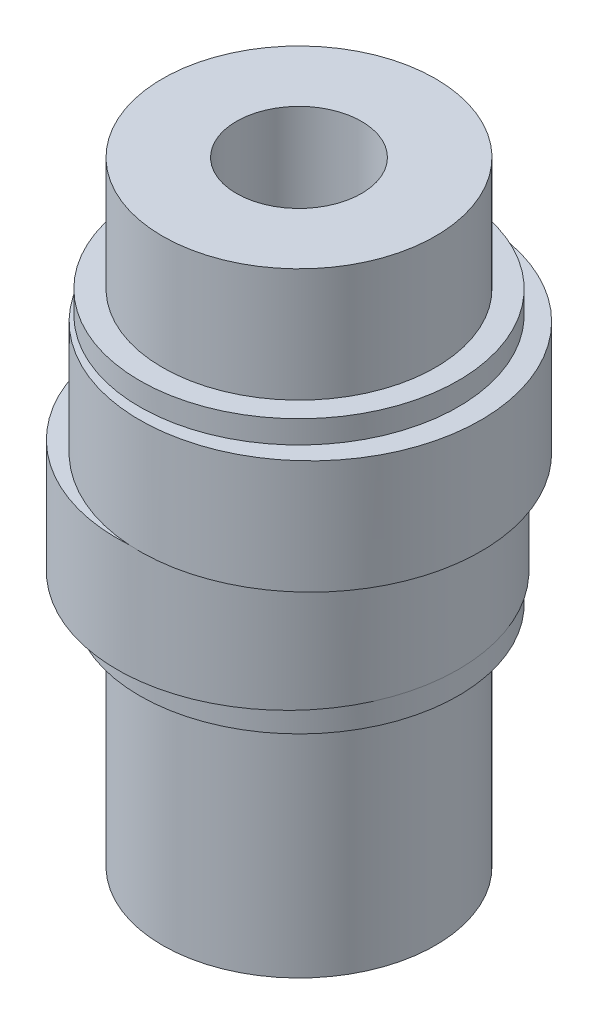
ISO-10303-21;
HEADER;
FILE_DESCRIPTION(('STEP AP214'),'2;1');
FILE_NAME('part.step','',(''),(''),'','','');
FILE_SCHEMA(('AUTOMOTIVE_DESIGN { 1 0 10303 214 1 1 1 1 }'));
ENDSEC;
DATA;
#1=APPLICATION_CONTEXT('core data for automotive mechanical design processes');
#2=APPLICATION_PROTOCOL_DEFINITION('international standard','automotive_design',2000,#1);
#3=PRODUCT_CONTEXT('',#1,'mechanical');
#4=PRODUCT('Part','Part','',(#3));
#5=PRODUCT_RELATED_PRODUCT_CATEGORY('part','',(#4));
#6=PRODUCT_DEFINITION_FORMATION('','',#4);
#7=PRODUCT_DEFINITION_CONTEXT('part definition',#1,'design');
#8=PRODUCT_DEFINITION('design','',#6,#7);
#9=PRODUCT_DEFINITION_SHAPE('','',#8);
#10=(LENGTH_UNIT() NAMED_UNIT(*) SI_UNIT(.MILLI.,.METRE.));
#11=(NAMED_UNIT(*) PLANE_ANGLE_UNIT() SI_UNIT($,.RADIAN.));
#12=(NAMED_UNIT(*) SI_UNIT($,.STERADIAN.) SOLID_ANGLE_UNIT());
#13=UNCERTAINTY_MEASURE_WITH_UNIT(LENGTH_MEASURE(1.E-05),#10,'distance_accuracy_value','');
#14=(GEOMETRIC_REPRESENTATION_CONTEXT(3) GLOBAL_UNCERTAINTY_ASSIGNED_CONTEXT((#13)) GLOBAL_UNIT_ASSIGNED_CONTEXT((#10,
#11,#12)) REPRESENTATION_CONTEXT('',''));
#15=CARTESIAN_POINT('',(0.,0.,0.));
#16=DIRECTION('',(0.,0.,1.));
#17=DIRECTION('',(1.,0.,0.));
#18=AXIS2_PLACEMENT_3D('',#15,#16,#17);
#19=CARTESIAN_POINT('',(-0.5,5.,0.));
#20=DIRECTION('',(0.,-1.,0.));
#21=DIRECTION('',(0.,0.,-1.));
#22=AXIS2_PLACEMENT_3D('',#19,#20,#21);
#23=CYLINDRICAL_SURFACE('',#22,7.5);
#24=CARTESIAN_POINT('',(-0.5,5.,0.));
#25=DIRECTION('',(0.,1.,0.));
#26=DIRECTION('',(0.,0.,1.));
#27=AXIS2_PLACEMENT_3D('',#24,#25,#26);
#28=CIRCLE('',#27,7.5);
#29=CARTESIAN_POINT('',(0.,5.,7.48331477354788));
#30=VERTEX_POINT('',#29);
#31=CARTESIAN_POINT('',(0.,5.,-7.48331477354788));
#32=VERTEX_POINT('',#31);
#33=EDGE_CURVE('E149',#30,#32,#28,.T.);
#34=ORIENTED_EDGE('',*,*,#33,.F.);
#35=EDGE_CURVE('E169',#32,#30,#28,.T.);
#36=ORIENTED_EDGE('',*,*,#35,.F.);
#37=EDGE_LOOP('',(#34,#36));
#38=FACE_BOUND('',#37,.T.);
#39=CARTESIAN_POINT('',(-0.5,0.,0.));
#40=DIRECTION('',(0.,1.,0.));
#41=DIRECTION('',(0.,0.,1.));
#42=AXIS2_PLACEMENT_3D('',#39,#40,#41);
#43=CIRCLE('',#42,7.5);
#44=CARTESIAN_POINT('',(7.,0.,0.));
#45=VERTEX_POINT('',#44);
#46=EDGE_CURVE('E162',#45,#45,#43,.T.);
#47=ORIENTED_EDGE('',*,*,#46,.T.);
#48=EDGE_LOOP('',(#47));
#49=FACE_BOUND('',#48,.T.);
#50=ADVANCED_FACE('F58',(#38,#49),#23,.T.);
#51=CARTESIAN_POINT('',(-0.5,5.,0.));
#52=DIRECTION('',(0.,1.,0.));
#53=DIRECTION('',(0.,0.,1.));
#54=AXIS2_PLACEMENT_3D('',#51,#52,#53);
#55=PLANE('',#54);
#56=CARTESIAN_POINT('',(0.5,5.,0.));
#57=DIRECTION('',(0.,1.,0.));
#58=DIRECTION('',(0.,0.,1.));
#59=AXIS2_PLACEMENT_3D('',#56,#57,#58);
#60=CIRCLE('',#59,7.5);
#61=EDGE_CURVE('E163',#32,#30,#60,.T.);
#62=ORIENTED_EDGE('',*,*,#61,.F.);
#63=ORIENTED_EDGE('',*,*,#35,.T.);
#64=EDGE_LOOP('',(#62,#63));
#65=FACE_BOUND('',#64,.T.);
#66=ADVANCED_FACE('F183',(#65),#55,.T.);
#67=CARTESIAN_POINT('',(-0.5,0.,0.));
#68=DIRECTION('',(0.,1.,0.));
#69=DIRECTION('',(0.,0.,1.));
#70=AXIS2_PLACEMENT_3D('',#67,#68,#69);
#71=PLANE('',#70);
#72=ORIENTED_EDGE('',*,*,#46,.F.);
#73=CARTESIAN_POINT('',(0.,0.,0.));
#74=DIRECTION('',(0.,1.,0.));
#75=DIRECTION('',(0.,0.,1.));
#76=AXIS2_PLACEMENT_3D('',#73,#74,#75);
#77=CIRCLE('',#76,7.);
#78=EDGE_CURVE('E80',#45,#45,#77,.T.);
#79=ORIENTED_EDGE('',*,*,#78,.T.);
#80=EDGE_LOOP('',(#72,#79));
#81=FACE_BOUND('',#80,.T.);
#82=ADVANCED_FACE('F202',(#81),#71,.F.);
#83=CARTESIAN_POINT('',(0.5,5.,0.));
#84=DIRECTION('',(0.,1.,0.));
#85=DIRECTION('',(0.,0.,1.));
#86=AXIS2_PLACEMENT_3D('',#83,#84,#85);
#87=PLANE('',#86);
#88=EDGE_CURVE('E154',#30,#32,#60,.T.);
#89=ORIENTED_EDGE('',*,*,#88,.F.);
#90=ORIENTED_EDGE('',*,*,#33,.T.);
#91=EDGE_LOOP('',(#89,#90));
#92=FACE_BOUND('',#91,.T.);
#93=ADVANCED_FACE('F187',(#92),#87,.F.);
#94=CARTESIAN_POINT('',(0.5,10.,0.));
#95=DIRECTION('',(0.,-1.,0.));
#96=DIRECTION('',(0.,0.,-1.));
#97=AXIS2_PLACEMENT_3D('',#94,#95,#96);
#98=CYLINDRICAL_SURFACE('',#97,7.5);
#99=CARTESIAN_POINT('',(0.5,10.,0.));
#100=DIRECTION('',(0.,1.,0.));
#101=DIRECTION('',(0.,0.,1.));
#102=AXIS2_PLACEMENT_3D('',#99,#100,#101);
#103=CIRCLE('',#102,7.5);
#104=CARTESIAN_POINT('',(-7.,10.,0.));
#105=VERTEX_POINT('',#104);
#106=EDGE_CURVE('E158',#105,#105,#103,.T.);
#107=ORIENTED_EDGE('',*,*,#106,.F.);
#108=EDGE_LOOP('',(#107));
#109=FACE_BOUND('',#108,.T.);
#110=ORIENTED_EDGE('',*,*,#61,.T.);
#111=ORIENTED_EDGE('',*,*,#88,.T.);
#112=EDGE_LOOP('',(#110,#111));
#113=FACE_BOUND('',#112,.T.);
#114=ADVANCED_FACE('F190',(#109,#113),#98,.T.);
#115=CARTESIAN_POINT('',(0.5,10.,0.));
#116=DIRECTION('',(0.,1.,0.));
#117=DIRECTION('',(0.,0.,1.));
#118=AXIS2_PLACEMENT_3D('',#115,#116,#117);
#119=PLANE('',#118);
#120=ORIENTED_EDGE('',*,*,#106,.T.);
#121=CARTESIAN_POINT('',(0.,10.,0.));
#122=DIRECTION('',(0.,1.,0.));
#123=DIRECTION('',(0.,0.,1.));
#124=AXIS2_PLACEMENT_3D('',#121,#122,#123);
#125=CIRCLE('',#124,7.);
#126=EDGE_CURVE('E145',#105,#105,#125,.T.);
#127=ORIENTED_EDGE('',*,*,#126,.F.);
#128=EDGE_LOOP('',(#120,#127));
#129=FACE_BOUND('',#128,.T.);
#130=ADVANCED_FACE('F192',(#129),#119,.T.);
#131=CARTESIAN_POINT('',(0.,11.,0.));
#132=DIRECTION('',(0.,-1.,0.));
#133=DIRECTION('',(0.,0.,-1.));
#134=AXIS2_PLACEMENT_3D('',#131,#132,#133);
#135=CYLINDRICAL_SURFACE('',#134,7.);
#136=CARTESIAN_POINT('',(0.,11.,0.));
#137=DIRECTION('',(0.,1.,0.));
#138=DIRECTION('',(0.,0.,1.));
#139=AXIS2_PLACEMENT_3D('',#136,#137,#138);
#140=CIRCLE('',#139,7.);
#141=CARTESIAN_POINT('',(0.,11.,7.));
#142=VERTEX_POINT('',#141);
#143=EDGE_CURVE('E150',#142,#142,#140,.T.);
#144=ORIENTED_EDGE('',*,*,#143,.F.);
#145=EDGE_LOOP('',(#144));
#146=FACE_BOUND('',#145,.T.);
#147=ORIENTED_EDGE('',*,*,#126,.T.);
#148=EDGE_LOOP('',(#147));
#149=FACE_BOUND('',#148,.T.);
#150=ADVANCED_FACE('F199',(#146,#149),#135,.T.);
#151=CARTESIAN_POINT('',(0.,11.,0.));
#152=DIRECTION('',(0.,1.,0.));
#153=DIRECTION('',(0.,0.,1.));
#154=AXIS2_PLACEMENT_3D('',#151,#152,#153);
#155=PLANE('',#154);
#156=CARTESIAN_POINT('',(0.,11.,0.));
#157=DIRECTION('',(0.,1.,0.));
#158=DIRECTION('',(0.,0.,1.));
#159=AXIS2_PLACEMENT_3D('',#156,#157,#158);
#160=CIRCLE('',#159,6.);
#161=CARTESIAN_POINT('',(0.,11.,6.));
#162=VERTEX_POINT('',#161);
#163=EDGE_CURVE('E67',#162,#162,#160,.T.);
#164=ORIENTED_EDGE('',*,*,#163,.F.);
#165=EDGE_LOOP('',(#164));
#166=FACE_BOUND('',#165,.T.);
#167=ORIENTED_EDGE('',*,*,#143,.T.);
#168=EDGE_LOOP('',(#167));
#169=FACE_BOUND('',#168,.T.);
#170=ADVANCED_FACE('F239',(#166,#169),#155,.T.);
#171=CARTESIAN_POINT('',(0.,16.,0.));
#172=DIRECTION('',(0.,-1.,0.));
#173=DIRECTION('',(0.,0.,-1.));
#174=AXIS2_PLACEMENT_3D('',#171,#172,#173);
#175=CYLINDRICAL_SURFACE('',#174,6.);
#176=CARTESIAN_POINT('',(0.,16.,0.));
#177=DIRECTION('',(0.,1.,0.));
#178=DIRECTION('',(0.,0.,1.));
#179=AXIS2_PLACEMENT_3D('',#176,#177,#178);
#180=CIRCLE('',#179,6.);
#181=CARTESIAN_POINT('',(0.,16.,6.));
#182=VERTEX_POINT('',#181);
#183=EDGE_CURVE('E139',#182,#182,#180,.T.);
#184=ORIENTED_EDGE('',*,*,#183,.F.);
#185=EDGE_LOOP('',(#184));
#186=FACE_BOUND('',#185,.T.);
#187=ORIENTED_EDGE('',*,*,#163,.T.);
#188=EDGE_LOOP('',(#187));
#189=FACE_BOUND('',#188,.T.);
#190=ADVANCED_FACE('F249',(#186,#189),#175,.T.);
#191=CARTESIAN_POINT('',(0.,16.,0.));
#192=DIRECTION('',(0.,1.,0.));
#193=DIRECTION('',(0.,0.,1.));
#194=AXIS2_PLACEMENT_3D('',#191,#192,#193);
#195=PLANE('',#194);
#196=CARTESIAN_POINT('',(0.,16.,0.));
#197=DIRECTION('',(0.,1.,0.));
#198=DIRECTION('',(0.,0.,1.));
#199=AXIS2_PLACEMENT_3D('',#196,#197,#198);
#200=CIRCLE('',#199,2.75);
#201=CARTESIAN_POINT('',(0.,16.,2.75));
#202=VERTEX_POINT('',#201);
#203=EDGE_CURVE('E442',#202,#202,#200,.T.);
#204=ORIENTED_EDGE('',*,*,#203,.F.);
#205=EDGE_LOOP('',(#204));
#206=FACE_BOUND('',#205,.T.);
#207=ORIENTED_EDGE('',*,*,#183,.T.);
#208=EDGE_LOOP('',(#207));
#209=FACE_BOUND('',#208,.T.);
#210=ADVANCED_FACE('F259',(#206,#209),#195,.T.);
#211=CARTESIAN_POINT('',(0.,-1.,0.));
#212=DIRECTION('',(0.,1.,0.));
#213=DIRECTION('',(0.,0.,1.));
#214=AXIS2_PLACEMENT_3D('',#211,#212,#213);
#215=CYLINDRICAL_SURFACE('',#214,7.);
#216=CARTESIAN_POINT('',(0.,-1.,0.));
#217=DIRECTION('',(0.,1.,0.));
#218=DIRECTION('',(0.,0.,1.));
#219=AXIS2_PLACEMENT_3D('',#216,#217,#218);
#220=CIRCLE('',#219,7.);
#221=CARTESIAN_POINT('',(0.,-1.,7.));
#222=VERTEX_POINT('',#221);
#223=EDGE_CURVE('E135',#222,#222,#220,.T.);
#224=ORIENTED_EDGE('',*,*,#223,.T.);
#225=EDGE_LOOP('',(#224));
#226=FACE_BOUND('',#225,.T.);
#227=ORIENTED_EDGE('',*,*,#78,.F.);
#228=EDGE_LOOP('',(#227));
#229=FACE_BOUND('',#228,.T.);
#230=ADVANCED_FACE('F270',(#226,#229),#215,.T.);
#231=CARTESIAN_POINT('',(0.,-1.,0.));
#232=DIRECTION('',(0.,1.,0.));
#233=DIRECTION('',(0.,0.,1.));
#234=AXIS2_PLACEMENT_3D('',#231,#232,#233);
#235=PLANE('',#234);
#236=CARTESIAN_POINT('',(0.,-1.,0.));
#237=DIRECTION('',(0.,-1.,0.));
#238=DIRECTION('',(0.,0.,-1.));
#239=AXIS2_PLACEMENT_3D('',#236,#237,#238);
#240=CIRCLE('',#239,6.);
#241=CARTESIAN_POINT('',(0.,-1.,-6.));
#242=VERTEX_POINT('',#241);
#243=EDGE_CURVE('E13',#242,#242,#240,.T.);
#244=ORIENTED_EDGE('',*,*,#243,.F.);
#245=EDGE_LOOP('',(#244));
#246=FACE_BOUND('',#245,.T.);
#247=ORIENTED_EDGE('',*,*,#223,.F.);
#248=EDGE_LOOP('',(#247));
#249=FACE_BOUND('',#248,.T.);
#250=ADVANCED_FACE('F282',(#246,#249),#235,.F.);
#251=CARTESIAN_POINT('',(0.,-6.,0.));
#252=DIRECTION('',(0.,1.,0.));
#253=DIRECTION('',(0.,0.,1.));
#254=AXIS2_PLACEMENT_3D('',#251,#252,#253);
#255=CYLINDRICAL_SURFACE('',#254,6.);
#256=ORIENTED_EDGE('',*,*,#243,.T.);
#257=EDGE_LOOP('',(#256));
#258=FACE_BOUND('',#257,.T.);
#259=CARTESIAN_POINT('',(0.,-11.,0.));
#260=DIRECTION('',(0.,-1.,0.));
#261=DIRECTION('',(0.,0.,-1.));
#262=AXIS2_PLACEMENT_3D('',#259,#260,#261);
#263=CIRCLE('',#262,6.);
#264=CARTESIAN_POINT('',(0.,-11.,-6.));
#265=VERTEX_POINT('',#264);
#266=EDGE_CURVE('E120',#265,#265,#263,.T.);
#267=ORIENTED_EDGE('',*,*,#266,.F.);
#268=EDGE_LOOP('',(#267));
#269=FACE_BOUND('',#268,.T.);
#270=ADVANCED_FACE('F292',(#258,#269),#255,.T.);
#271=CARTESIAN_POINT('',(-3.,-11.,0.));
#272=DIRECTION('',(1.,0.,0.));
#273=DIRECTION('',(0.,0.,-1.));
#274=AXIS2_PLACEMENT_3D('',#271,#272,#273);
#275=PLANE('',#274);
#276=DIRECTION('',(0.,0.,-1.));
#277=VECTOR('',#276,1.);
#278=CARTESIAN_POINT('',(-3.,-6.,0.));
#279=LINE('',#278,#277);
#280=CARTESIAN_POINT('',(-3.,-6.,4.));
#281=VERTEX_POINT('',#280);
#282=CARTESIAN_POINT('',(-3.,-6.,-4.));
#283=VERTEX_POINT('',#282);
#284=EDGE_CURVE('E106',#281,#283,#279,.T.);
#285=ORIENTED_EDGE('',*,*,#284,.F.);
#286=DIRECTION('',(0.,1.,0.));
#287=VECTOR('',#286,1.);
#288=CARTESIAN_POINT('',(-3.,-11.,4.));
#289=LINE('',#288,#287);
#290=CARTESIAN_POINT('',(-3.,-11.,4.));
#291=VERTEX_POINT('',#290);
#292=EDGE_CURVE('E100',#291,#281,#289,.T.);
#293=ORIENTED_EDGE('',*,*,#292,.F.);
#294=DIRECTION('',(0.,0.,-1.));
#295=VECTOR('',#294,1.);
#296=CARTESIAN_POINT('',(-3.,-11.,0.));
#297=LINE('',#296,#295);
#298=CARTESIAN_POINT('',(-3.,-11.,-4.));
#299=VERTEX_POINT('',#298);
#300=EDGE_CURVE('E104',#291,#299,#297,.T.);
#301=ORIENTED_EDGE('',*,*,#300,.T.);
#302=DIRECTION('',(0.,1.,0.));
#303=VECTOR('',#302,1.);
#304=CARTESIAN_POINT('',(-3.,-11.,-4.));
#305=LINE('',#304,#303);
#306=EDGE_CURVE('E110',#299,#283,#305,.T.);
#307=ORIENTED_EDGE('',*,*,#306,.T.);
#308=EDGE_LOOP('',(#285,#293,#301,#307));
#309=FACE_BOUND('',#308,.T.);
#310=ADVANCED_FACE('F102',(#309),#275,.T.);
#311=CARTESIAN_POINT('',(0.,-11.,0.));
#312=DIRECTION('',(0.,1.,0.));
#313=DIRECTION('',(0.,0.,1.));
#314=AXIS2_PLACEMENT_3D('',#311,#312,#313);
#315=CYLINDRICAL_SURFACE('',#314,5.);
#316=CARTESIAN_POINT('',(0.,-6.,0.));
#317=DIRECTION('',(0.,-1.,0.));
#318=DIRECTION('',(0.,0.,-1.));
#319=AXIS2_PLACEMENT_3D('',#316,#317,#318);
#320=CIRCLE('',#319,5.);
#321=EDGE_CURVE('E74',#283,#281,#320,.T.);
#322=ORIENTED_EDGE('',*,*,#321,.F.);
#323=ORIENTED_EDGE('',*,*,#306,.F.);
#324=CARTESIAN_POINT('',(0.,-11.,0.));
#325=DIRECTION('',(0.,-1.,0.));
#326=DIRECTION('',(0.,0.,-1.));
#327=AXIS2_PLACEMENT_3D('',#324,#325,#326);
#328=CIRCLE('',#327,5.);
#329=EDGE_CURVE('E115',#299,#291,#328,.T.);
#330=ORIENTED_EDGE('',*,*,#329,.T.);
#331=ORIENTED_EDGE('',*,*,#292,.T.);
#332=EDGE_LOOP('',(#322,#323,#330,#331));
#333=FACE_BOUND('',#332,.T.);
#334=ADVANCED_FACE('F118',(#333),#315,.F.);
#335=CARTESIAN_POINT('',(0.,-11.,0.));
#336=DIRECTION('',(0.,-1.,0.));
#337=DIRECTION('',(0.,0.,-1.));
#338=AXIS2_PLACEMENT_3D('',#335,#336,#337);
#339=PLANE('',#338);
#340=ORIENTED_EDGE('',*,*,#300,.F.);
#341=ORIENTED_EDGE('',*,*,#329,.F.);
#342=EDGE_LOOP('',(#340,#341));
#343=FACE_BOUND('',#342,.T.);
#344=ORIENTED_EDGE('',*,*,#266,.T.);
#345=EDGE_LOOP('',(#344));
#346=FACE_BOUND('',#345,.T.);
#347=ADVANCED_FACE('F113',(#343,#346),#339,.T.);
#348=CARTESIAN_POINT('',(0.,-6.,0.));
#349=DIRECTION('',(0.,-1.,0.));
#350=DIRECTION('',(0.,0.,-1.));
#351=AXIS2_PLACEMENT_3D('',#348,#349,#350);
#352=PLANE('',#351);
#353=CARTESIAN_POINT('',(0.,-6.,0.));
#354=DIRECTION('',(0.,-1.,0.));
#355=DIRECTION('',(0.,0.,-1.));
#356=AXIS2_PLACEMENT_3D('',#353,#354,#355);
#357=CIRCLE('',#356,2.75);
#358=CARTESIAN_POINT('',(0.,-6.,-2.75));
#359=VERTEX_POINT('',#358);
#360=EDGE_CURVE('E61',#359,#359,#357,.T.);
#361=ORIENTED_EDGE('',*,*,#360,.F.);
#362=EDGE_LOOP('',(#361));
#363=FACE_BOUND('',#362,.T.);
#364=ORIENTED_EDGE('',*,*,#284,.T.);
#365=ORIENTED_EDGE('',*,*,#321,.T.);
#366=EDGE_LOOP('',(#364,#365));
#367=FACE_BOUND('',#366,.T.);
#368=ADVANCED_FACE('F326',(#363,#367),#352,.T.);
#369=CARTESIAN_POINT('',(0.,-11.,0.));
#370=DIRECTION('',(0.,1.,0.));
#371=DIRECTION('',(0.,0.,1.));
#372=AXIS2_PLACEMENT_3D('',#369,#370,#371);
#373=CYLINDRICAL_SURFACE('',#372,2.75);
#374=ORIENTED_EDGE('',*,*,#360,.T.);
#375=EDGE_LOOP('',(#374));
#376=FACE_BOUND('',#375,.T.);
#377=ORIENTED_EDGE('',*,*,#203,.T.);
#378=EDGE_LOOP('',(#377));
#379=FACE_BOUND('',#378,.T.);
#380=ADVANCED_FACE('F334',(#376,#379),#373,.F.);
#381=CLOSED_SHELL('',(#50,#66,#82,#93,#114,#130,#150,#170,#190,#210,#230,#250,#270,#310,#334,
#347,#368,#380));
#382=MANIFOLD_SOLID_BREP('B2',#381);
#383=ADVANCED_BREP_SHAPE_REPRESENTATION('',(#18,#382),#14);
#384=SHAPE_DEFINITION_REPRESENTATION(#9,#383);
ENDSEC;
END-ISO-10303-21;
